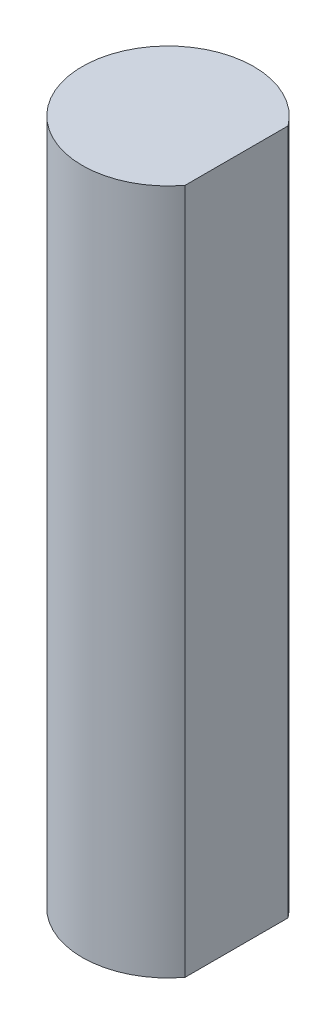
ISO-10303-21;
HEADER;
FILE_DESCRIPTION(('STEP AP214'),'2;1');
FILE_NAME('part.step','',(''),(''),'','','');
FILE_SCHEMA(('AUTOMOTIVE_DESIGN { 1 0 10303 214 1 1 1 1 }'));
ENDSEC;
DATA;
#1=APPLICATION_CONTEXT('core data for automotive mechanical design processes');
#2=APPLICATION_PROTOCOL_DEFINITION('international standard','automotive_design',2000,#1);
#3=PRODUCT_CONTEXT('',#1,'mechanical');
#4=PRODUCT('Part','Part','',(#3));
#5=PRODUCT_RELATED_PRODUCT_CATEGORY('part','',(#4));
#6=PRODUCT_DEFINITION_FORMATION('','',#4);
#7=PRODUCT_DEFINITION_CONTEXT('part definition',#1,'design');
#8=PRODUCT_DEFINITION('design','',#6,#7);
#9=PRODUCT_DEFINITION_SHAPE('','',#8);
#10=(LENGTH_UNIT() NAMED_UNIT(*) SI_UNIT(.MILLI.,.METRE.));
#11=(NAMED_UNIT(*) PLANE_ANGLE_UNIT() SI_UNIT($,.RADIAN.));
#12=(NAMED_UNIT(*) SI_UNIT($,.STERADIAN.) SOLID_ANGLE_UNIT());
#13=UNCERTAINTY_MEASURE_WITH_UNIT(LENGTH_MEASURE(1.E-05),#10,'distance_accuracy_value','');
#14=(GEOMETRIC_REPRESENTATION_CONTEXT(3) GLOBAL_UNCERTAINTY_ASSIGNED_CONTEXT((#13)) GLOBAL_UNIT_ASSIGNED_CONTEXT((#10,
#11,#12)) REPRESENTATION_CONTEXT('',''));
#15=CARTESIAN_POINT('',(0.,0.,0.));
#16=DIRECTION('',(0.,0.,1.));
#17=DIRECTION('',(1.,0.,0.));
#18=AXIS2_PLACEMENT_3D('',#15,#16,#17);
#19=CARTESIAN_POINT('',(0.,25.4,0.));
#20=DIRECTION('',(0.,-1.,0.));
#21=DIRECTION('',(0.,0.,-1.));
#22=AXIS2_PLACEMENT_3D('',#19,#20,#21);
#23=CYLINDRICAL_SURFACE('',#22,3.175);
#24=CARTESIAN_POINT('',(0.,0.,0.));
#25=DIRECTION('',(0.,1.,0.));
#26=DIRECTION('',(0.,0.,1.));
#27=AXIS2_PLACEMENT_3D('',#24,#25,#26);
#28=CIRCLE('',#27,3.175);
#29=CARTESIAN_POINT('',(2.54,0.,-1.905));
#30=VERTEX_POINT('',#29);
#31=CARTESIAN_POINT('',(2.54,0.,1.905));
#32=VERTEX_POINT('',#31);
#33=EDGE_CURVE('E60',#30,#32,#28,.T.);
#34=ORIENTED_EDGE('',*,*,#33,.T.);
#35=DIRECTION('',(0.,-1.,0.));
#36=VECTOR('',#35,1.);
#37=CARTESIAN_POINT('',(2.54,25.4,1.905));
#38=LINE('',#37,#36);
#39=CARTESIAN_POINT('',(2.54,25.4,1.905));
#40=VERTEX_POINT('',#39);
#41=EDGE_CURVE('E11',#40,#32,#38,.T.);
#42=ORIENTED_EDGE('',*,*,#41,.F.);
#43=CARTESIAN_POINT('',(0.,25.4,0.));
#44=DIRECTION('',(0.,1.,0.));
#45=DIRECTION('',(0.,0.,1.));
#46=AXIS2_PLACEMENT_3D('',#43,#44,#45);
#47=CIRCLE('',#46,3.175);
#48=CARTESIAN_POINT('',(2.54,25.4,-1.905));
#49=VERTEX_POINT('',#48);
#50=EDGE_CURVE('E62',#49,#40,#47,.T.);
#51=ORIENTED_EDGE('',*,*,#50,.F.);
#52=DIRECTION('',(0.,-1.,0.));
#53=VECTOR('',#52,1.);
#54=CARTESIAN_POINT('',(2.54,25.4,-1.905));
#55=LINE('',#54,#53);
#56=EDGE_CURVE('E44',#49,#30,#55,.T.);
#57=ORIENTED_EDGE('',*,*,#56,.T.);
#58=EDGE_LOOP('',(#34,#42,#51,#57));
#59=FACE_BOUND('',#58,.T.);
#60=ADVANCED_FACE('F36',(#59),#23,.T.);
#61=CARTESIAN_POINT('',(2.54,25.4,0.));
#62=DIRECTION('',(1.,0.,0.));
#63=DIRECTION('',(0.,0.,-1.));
#64=AXIS2_PLACEMENT_3D('',#61,#62,#63);
#65=PLANE('',#64);
#66=DIRECTION('',(0.,0.,1.));
#67=VECTOR('',#66,1.);
#68=CARTESIAN_POINT('',(2.54,0.,0.));
#69=LINE('',#68,#67);
#70=EDGE_CURVE('E67',#30,#32,#69,.T.);
#71=ORIENTED_EDGE('',*,*,#70,.F.);
#72=ORIENTED_EDGE('',*,*,#56,.F.);
#73=DIRECTION('',(0.,0.,1.));
#74=VECTOR('',#73,1.);
#75=CARTESIAN_POINT('',(2.54,25.4,0.));
#76=LINE('',#75,#74);
#77=EDGE_CURVE('E64',#49,#40,#76,.T.);
#78=ORIENTED_EDGE('',*,*,#77,.T.);
#79=ORIENTED_EDGE('',*,*,#41,.T.);
#80=EDGE_LOOP('',(#71,#72,#78,#79));
#81=FACE_BOUND('',#80,.T.);
#82=ADVANCED_FACE('F69',(#81),#65,.T.);
#83=CARTESIAN_POINT('',(0.,25.4,0.));
#84=DIRECTION('',(0.,1.,0.));
#85=DIRECTION('',(0.,0.,1.));
#86=AXIS2_PLACEMENT_3D('',#83,#84,#85);
#87=PLANE('',#86);
#88=ORIENTED_EDGE('',*,*,#50,.T.);
#89=ORIENTED_EDGE('',*,*,#77,.F.);
#90=EDGE_LOOP('',(#88,#89));
#91=FACE_BOUND('',#90,.T.);
#92=ADVANCED_FACE('F74',(#91),#87,.T.);
#93=CARTESIAN_POINT('',(0.,0.,0.));
#94=DIRECTION('',(0.,1.,0.));
#95=DIRECTION('',(0.,0.,1.));
#96=AXIS2_PLACEMENT_3D('',#93,#94,#95);
#97=PLANE('',#96);
#98=ORIENTED_EDGE('',*,*,#33,.F.);
#99=ORIENTED_EDGE('',*,*,#70,.T.);
#100=EDGE_LOOP('',(#98,#99));
#101=FACE_BOUND('',#100,.T.);
#102=ADVANCED_FACE('F66',(#101),#97,.F.);
#103=CLOSED_SHELL('',(#60,#82,#92,#102));
#104=MANIFOLD_SOLID_BREP('B2',#103);
#105=ADVANCED_BREP_SHAPE_REPRESENTATION('',(#18,#104),#14);
#106=SHAPE_DEFINITION_REPRESENTATION(#9,#105);
ENDSEC;
END-ISO-10303-21;
